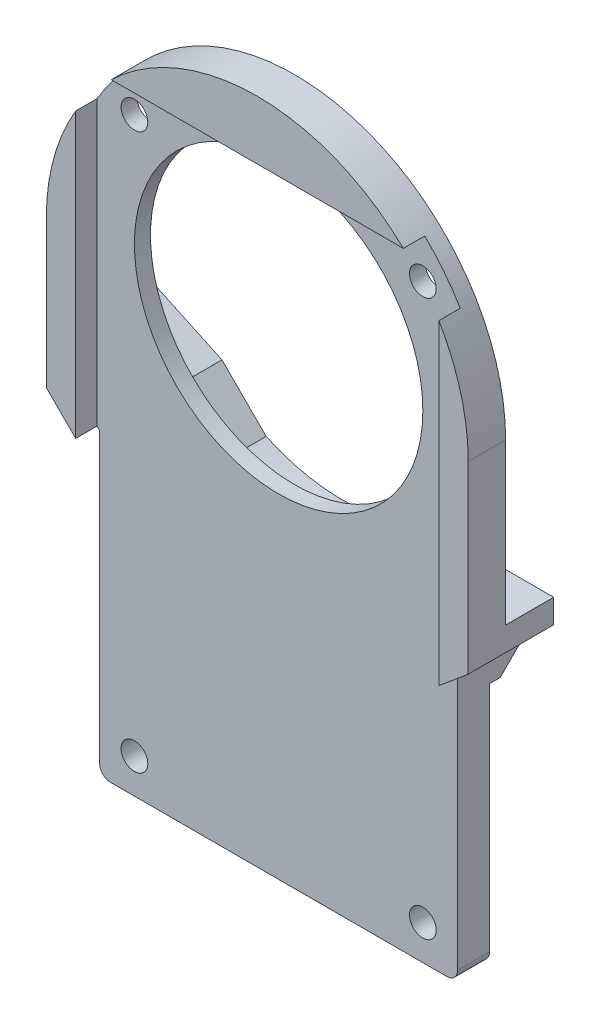
ISO-10303-21;
HEADER;
FILE_DESCRIPTION(('STEP AP214'),'2;1');
FILE_NAME('part.step','',(''),(''),'','','');
FILE_SCHEMA(('AUTOMOTIVE_DESIGN { 1 0 10303 214 1 1 1 1 }'));
ENDSEC;
DATA;
#1=APPLICATION_CONTEXT('core data for automotive mechanical design processes');
#2=APPLICATION_PROTOCOL_DEFINITION('international standard','automotive_design',2000,#1);
#3=PRODUCT_CONTEXT('',#1,'mechanical');
#4=PRODUCT('Part','Part','',(#3));
#5=PRODUCT_RELATED_PRODUCT_CATEGORY('part','',(#4));
#6=PRODUCT_DEFINITION_FORMATION('','',#4);
#7=PRODUCT_DEFINITION_CONTEXT('part definition',#1,'design');
#8=PRODUCT_DEFINITION('design','',#6,#7);
#9=PRODUCT_DEFINITION_SHAPE('','',#8);
#10=(LENGTH_UNIT() NAMED_UNIT(*) SI_UNIT(.MILLI.,.METRE.));
#11=(NAMED_UNIT(*) PLANE_ANGLE_UNIT() SI_UNIT($,.RADIAN.));
#12=(NAMED_UNIT(*) SI_UNIT($,.STERADIAN.) SOLID_ANGLE_UNIT());
#13=UNCERTAINTY_MEASURE_WITH_UNIT(LENGTH_MEASURE(1.E-05),#10,'distance_accuracy_value','');
#14=(GEOMETRIC_REPRESENTATION_CONTEXT(3) GLOBAL_UNCERTAINTY_ASSIGNED_CONTEXT((#13)) GLOBAL_UNIT_ASSIGNED_CONTEXT((#10,
#11,#12)) REPRESENTATION_CONTEXT('',''));
#15=CARTESIAN_POINT('',(0.,0.,0.));
#16=DIRECTION('',(0.,0.,1.));
#17=DIRECTION('',(1.,0.,0.));
#18=AXIS2_PLACEMENT_3D('',#15,#16,#17);
#19=CARTESIAN_POINT('',(0.,0.,0.));
#20=DIRECTION('',(0.,0.,1.));
#21=DIRECTION('',(1.,0.,0.));
#22=AXIS2_PLACEMENT_3D('',#19,#20,#21);
#23=PLANE('',#22);
#24=CARTESIAN_POINT('',(-13.5,-41.5,0.));
#25=DIRECTION('',(0.,0.,-1.));
#26=DIRECTION('',(-1.,0.,0.));
#27=AXIS2_PLACEMENT_3D('',#24,#25,#26);
#28=CIRCLE('',#27,2.75);
#29=CARTESIAN_POINT('',(-16.25,-41.5,0.));
#30=VERTEX_POINT('',#29);
#31=EDGE_CURVE('E354',#30,#30,#28,.T.);
#32=ORIENTED_EDGE('',*,*,#31,.F.);
#33=EDGE_LOOP('',(#32));
#34=FACE_BOUND('',#33,.T.);
#35=CARTESIAN_POINT('',(13.5,-41.5,0.));
#36=DIRECTION('',(0.,0.,-1.));
#37=DIRECTION('',(-1.,0.,0.));
#38=AXIS2_PLACEMENT_3D('',#35,#36,#37);
#39=CIRCLE('',#38,2.75);
#40=CARTESIAN_POINT('',(10.75,-41.5,0.));
#41=VERTEX_POINT('',#40);
#42=EDGE_CURVE('E351',#41,#41,#39,.T.);
#43=ORIENTED_EDGE('',*,*,#42,.F.);
#44=EDGE_LOOP('',(#43));
#45=FACE_BOUND('',#44,.T.);
#46=DIRECTION('',(1.,0.,0.));
#47=VECTOR('',#46,1.);
#48=CARTESIAN_POINT('',(-16.7500000000001,-44.75,0.));
#49=LINE('',#48,#47);
#50=CARTESIAN_POINT('',(-15.7500000000001,-44.75,0.));
#51=VERTEX_POINT('',#50);
#52=CARTESIAN_POINT('',(15.7500000000001,-44.75,0.));
#53=VERTEX_POINT('',#52);
#54=EDGE_CURVE('E377',#51,#53,#49,.T.);
#55=ORIENTED_EDGE('',*,*,#54,.F.);
#56=CARTESIAN_POINT('',(-15.7500000000001,-43.75,0.));
#57=DIRECTION('',(0.,0.,1.));
#58=DIRECTION('',(1.,0.,0.));
#59=AXIS2_PLACEMENT_3D('',#56,#57,#58);
#60=CIRCLE('',#59,1.);
#61=CARTESIAN_POINT('',(-16.7500000000001,-43.75,0.));
#62=VERTEX_POINT('',#61);
#63=EDGE_CURVE('E441',#51,#62,#60,.F.);
#64=ORIENTED_EDGE('',*,*,#63,.T.);
#65=DIRECTION('',(0.,-1.,0.));
#66=VECTOR('',#65,1.);
#67=CARTESIAN_POINT('',(-16.7500000000001,-16.75,0.));
#68=LINE('',#67,#66);
#69=CARTESIAN_POINT('',(-16.7500000000001,-19.,0.));
#70=VERTEX_POINT('',#69);
#71=EDGE_CURVE('E375',#70,#62,#68,.T.);
#72=ORIENTED_EDGE('',*,*,#71,.F.);
#73=DIRECTION('',(-0.707106781186548,0.707106781186548,0.));
#74=VECTOR('',#73,1.);
#75=CARTESIAN_POINT('',(-16.7500000000001,-19.,0.));
#76=LINE('',#75,#74);
#77=CARTESIAN_POINT('',(-13.7500000000001,-22.,0.));
#78=VERTEX_POINT('',#77);
#79=EDGE_CURVE('E266',#78,#70,#76,.T.);
#80=ORIENTED_EDGE('',*,*,#79,.F.);
#81=DIRECTION('',(-1.,0.,0.));
#82=VECTOR('',#81,1.);
#83=CARTESIAN_POINT('',(16.7500000000001,-22.,0.));
#84=LINE('',#83,#82);
#85=CARTESIAN_POINT('',(16.75,-22.,0.));
#86=VERTEX_POINT('',#85);
#87=EDGE_CURVE('E283',#86,#78,#84,.T.);
#88=ORIENTED_EDGE('',*,*,#87,.F.);
#89=DIRECTION('',(0.,1.,0.));
#90=VECTOR('',#89,1.);
#91=CARTESIAN_POINT('',(16.75,-19.75,0.));
#92=LINE('',#91,#90);
#93=CARTESIAN_POINT('',(16.7500000000001,-43.75,0.));
#94=VERTEX_POINT('',#93);
#95=EDGE_CURVE('E362',#94,#86,#92,.T.);
#96=ORIENTED_EDGE('',*,*,#95,.F.);
#97=CARTESIAN_POINT('',(15.7500000000001,-43.75,0.));
#98=DIRECTION('',(0.,0.,1.));
#99=DIRECTION('',(1.,0.,0.));
#100=AXIS2_PLACEMENT_3D('',#97,#98,#99);
#101=CIRCLE('',#100,1.);
#102=EDGE_CURVE('E439',#94,#53,#101,.F.);
#103=ORIENTED_EDGE('',*,*,#102,.T.);
#104=EDGE_LOOP('',(#55,#64,#72,#80,#88,#96,#103));
#105=FACE_BOUND('',#104,.T.);
#106=ADVANCED_FACE('F43',(#34,#45,#105),#23,.F.);
#107=CARTESIAN_POINT('',(-13.5,-41.5,5.));
#108=DIRECTION('',(0.,0.,-1.));
#109=DIRECTION('',(-1.,0.,0.));
#110=AXIS2_PLACEMENT_3D('',#107,#108,#109);
#111=CYLINDRICAL_SURFACE('',#110,1.25000000000001);
#112=CARTESIAN_POINT('',(-13.5,-41.5,1.));
#113=DIRECTION('',(0.,0.,-1.));
#114=DIRECTION('',(-1.,0.,0.));
#115=AXIS2_PLACEMENT_3D('',#112,#113,#114);
#116=CIRCLE('',#115,1.25000000000001);
#117=CARTESIAN_POINT('',(-14.75,-41.5,1.));
#118=VERTEX_POINT('',#117);
#119=EDGE_CURVE('E378',#118,#118,#116,.T.);
#120=ORIENTED_EDGE('',*,*,#119,.T.);
#121=EDGE_LOOP('',(#120));
#122=FACE_BOUND('',#121,.T.);
#123=CARTESIAN_POINT('',(-13.5,-41.5,3.));
#124=DIRECTION('',(0.,0.,1.));
#125=DIRECTION('',(1.,0.,0.));
#126=AXIS2_PLACEMENT_3D('',#123,#124,#125);
#127=CIRCLE('',#126,1.25000000000001);
#128=CARTESIAN_POINT('',(-12.25,-41.5,3.));
#129=VERTEX_POINT('',#128);
#130=EDGE_CURVE('E337',#129,#129,#127,.T.);
#131=ORIENTED_EDGE('',*,*,#130,.T.);
#132=EDGE_LOOP('',(#131));
#133=FACE_BOUND('',#132,.T.);
#134=ADVANCED_FACE('F489',(#122,#133),#111,.F.);
#135=CARTESIAN_POINT('',(13.5,-41.5,5.));
#136=DIRECTION('',(0.,0.,-1.));
#137=DIRECTION('',(-1.,0.,0.));
#138=AXIS2_PLACEMENT_3D('',#135,#136,#137);
#139=CYLINDRICAL_SURFACE('',#138,1.25000000000001);
#140=CARTESIAN_POINT('',(13.5,-41.5,1.));
#141=DIRECTION('',(0.,0.,-1.));
#142=DIRECTION('',(-1.,0.,0.));
#143=AXIS2_PLACEMENT_3D('',#140,#141,#142);
#144=CIRCLE('',#143,1.25000000000001);
#145=CARTESIAN_POINT('',(12.25,-41.5,1.));
#146=VERTEX_POINT('',#145);
#147=EDGE_CURVE('E350',#146,#146,#144,.T.);
#148=ORIENTED_EDGE('',*,*,#147,.T.);
#149=EDGE_LOOP('',(#148));
#150=FACE_BOUND('',#149,.T.);
#151=CARTESIAN_POINT('',(13.5,-41.5,3.));
#152=DIRECTION('',(0.,0.,1.));
#153=DIRECTION('',(1.,0.,0.));
#154=AXIS2_PLACEMENT_3D('',#151,#152,#153);
#155=CIRCLE('',#154,1.25000000000001);
#156=CARTESIAN_POINT('',(14.75,-41.5,3.));
#157=VERTEX_POINT('',#156);
#158=EDGE_CURVE('E334',#157,#157,#155,.T.);
#159=ORIENTED_EDGE('',*,*,#158,.T.);
#160=EDGE_LOOP('',(#159));
#161=FACE_BOUND('',#160,.T.);
#162=ADVANCED_FACE('F495',(#150,#161),#139,.F.);
#163=CARTESIAN_POINT('',(0.,0.,5.));
#164=DIRECTION('',(0.,0.,1.));
#165=DIRECTION('',(1.,0.,0.));
#166=AXIS2_PLACEMENT_3D('',#163,#164,#165);
#167=PLANE('',#166);
#168=DIRECTION('',(0.,1.,0.));
#169=VECTOR('',#168,1.);
#170=CARTESIAN_POINT('',(17.,-44.75,5.));
#171=LINE('',#170,#169);
#172=CARTESIAN_POINT('',(17.,-19.5402250922056,5.));
#173=VERTEX_POINT('',#172);
#174=CARTESIAN_POINT('',(17.,10.0529846314417,5.));
#175=VERTEX_POINT('',#174);
#176=EDGE_CURVE('E300',#173,#175,#171,.T.);
#177=ORIENTED_EDGE('',*,*,#176,.F.);
#178=DIRECTION('',(0.766044443118993,0.642787609686521,0.));
#179=VECTOR('',#178,1.);
#180=CARTESIAN_POINT('',(16.75,-19.75,5.));
#181=LINE('',#180,#179);
#182=CARTESIAN_POINT('',(19.7500000000001,-17.2327011064682,5.));
#183=VERTEX_POINT('',#182);
#184=EDGE_CURVE('E359',#173,#183,#181,.T.);
#185=ORIENTED_EDGE('',*,*,#184,.T.);
#186=DIRECTION('',(0.,1.,0.));
#187=VECTOR('',#186,1.);
#188=CARTESIAN_POINT('',(19.7500000000001,-17.2327011064682,5.));
#189=LINE('',#188,#187);
#190=CARTESIAN_POINT('',(19.7500000000001,0.,5.));
#191=VERTEX_POINT('',#190);
#192=EDGE_CURVE('E361',#183,#191,#189,.T.);
#193=ORIENTED_EDGE('',*,*,#192,.T.);
#194=CARTESIAN_POINT('',(0.,0.,5.));
#195=DIRECTION('',(0.,0.,1.));
#196=DIRECTION('',(1.,0.,0.));
#197=AXIS2_PLACEMENT_3D('',#194,#195,#196);
#198=CIRCLE('',#197,19.7500000000001);
#199=EDGE_CURVE('E365',#191,#175,#198,.T.);
#200=ORIENTED_EDGE('',*,*,#199,.T.);
#201=EDGE_LOOP('',(#177,#185,#193,#200));
#202=FACE_BOUND('',#201,.T.);
#203=ADVANCED_FACE('F607',(#202),#167,.T.);
#204=DIRECTION('',(0.,-1.,0.));
#205=VECTOR('',#204,1.);
#206=CARTESIAN_POINT('',(-17.,-44.75,5.));
#207=LINE('',#206,#205);
#208=CARTESIAN_POINT('',(-17.,10.0529846314417,5.));
#209=VERTEX_POINT('',#208);
#210=CARTESIAN_POINT('',(-17.,-16.5000000000001,5.));
#211=VERTEX_POINT('',#210);
#212=EDGE_CURVE('E305',#209,#211,#207,.T.);
#213=ORIENTED_EDGE('',*,*,#212,.F.);
#214=CARTESIAN_POINT('',(-19.7500000000001,0.,5.));
#215=VERTEX_POINT('',#214);
#216=EDGE_CURVE('E364',#209,#215,#198,.T.);
#217=ORIENTED_EDGE('',*,*,#216,.T.);
#218=DIRECTION('',(0.,-1.,0.));
#219=VECTOR('',#218,1.);
#220=CARTESIAN_POINT('',(-19.7500000000001,-13.75,5.));
#221=LINE('',#220,#219);
#222=CARTESIAN_POINT('',(-19.7500000000001,-13.75,5.));
#223=VERTEX_POINT('',#222);
#224=EDGE_CURVE('E368',#215,#223,#221,.T.);
#225=ORIENTED_EDGE('',*,*,#224,.T.);
#226=DIRECTION('',(0.707106781186547,-0.707106781186547,0.));
#227=VECTOR('',#226,1.);
#228=CARTESIAN_POINT('',(-16.7500000000001,-16.75,5.));
#229=LINE('',#228,#227);
#230=EDGE_CURVE('E371',#223,#211,#229,.T.);
#231=ORIENTED_EDGE('',*,*,#230,.T.);
#232=EDGE_LOOP('',(#213,#217,#225,#231));
#233=FACE_BOUND('',#232,.T.);
#234=ADVANCED_FACE('F532',(#233),#167,.T.);
#235=CARTESIAN_POINT('',(-16.7500000000001,-16.75,5.));
#236=DIRECTION('',(1.,0.,0.));
#237=DIRECTION('',(0.,1.,0.));
#238=AXIS2_PLACEMENT_3D('',#235,#236,#237);
#239=PLANE('',#238);
#240=ORIENTED_EDGE('',*,*,#71,.T.);
#241=DIRECTION('',(0.,0.,-1.));
#242=VECTOR('',#241,1.);
#243=CARTESIAN_POINT('',(-16.7500000000001,-43.75,5.));
#244=LINE('',#243,#242);
#245=CARTESIAN_POINT('',(-16.7500000000001,-43.75,3.));
#246=VERTEX_POINT('',#245);
#247=EDGE_CURVE('E66',#62,#246,#244,.F.);
#248=ORIENTED_EDGE('',*,*,#247,.T.);
#249=DIRECTION('',(0.,-1.,0.));
#250=VECTOR('',#249,1.);
#251=CARTESIAN_POINT('',(-16.7500000000001,-16.75,3.));
#252=LINE('',#251,#250);
#253=CARTESIAN_POINT('',(-16.7500000000001,-16.75,3.));
#254=VERTEX_POINT('',#253);
#255=EDGE_CURVE('E325',#254,#246,#252,.T.);
#256=ORIENTED_EDGE('',*,*,#255,.F.);
#257=DIRECTION('',(0.,0.,-1.));
#258=VECTOR('',#257,1.);
#259=CARTESIAN_POINT('',(-16.7500000000001,-16.75,5.));
#260=LINE('',#259,#258);
#261=CARTESIAN_POINT('',(-16.7500000000001,-16.75,-2.59099025766972));
#262=VERTEX_POINT('',#261);
#263=EDGE_CURVE('E374',#254,#262,#260,.T.);
#264=ORIENTED_EDGE('',*,*,#263,.T.);
#265=DIRECTION('',(0.,-0.816496580927726,0.577350269189627));
#266=VECTOR('',#265,1.);
#267=CARTESIAN_POINT('',(-16.7500000000001,-16.3643819168359,-2.86366341922323));
#268=LINE('',#267,#266);
#269=CARTESIAN_POINT('',(-16.7500000000001,-19.,-0.999999999999984));
#270=VERTEX_POINT('',#269);
#271=EDGE_CURVE('E424',#262,#270,#268,.T.);
#272=ORIENTED_EDGE('',*,*,#271,.T.);
#273=DIRECTION('',(0.,0.,1.));
#274=VECTOR('',#273,1.);
#275=CARTESIAN_POINT('',(-16.7500000000001,-19.,-3.));
#276=LINE('',#275,#274);
#277=EDGE_CURVE('E282',#270,#70,#276,.T.);
#278=ORIENTED_EDGE('',*,*,#277,.T.);
#279=EDGE_LOOP('',(#240,#248,#256,#264,#272,#278));
#280=FACE_BOUND('',#279,.T.);
#281=ADVANCED_FACE('F457',(#280),#239,.F.);
#282=CARTESIAN_POINT('',(-16.7500000000001,-44.75,5.));
#283=DIRECTION('',(0.,1.,0.));
#284=DIRECTION('',(-1.,0.,0.));
#285=AXIS2_PLACEMENT_3D('',#282,#283,#284);
#286=PLANE('',#285);
#287=DIRECTION('',(1.,0.,0.));
#288=VECTOR('',#287,1.);
#289=CARTESIAN_POINT('',(17.,-44.75,3.));
#290=LINE('',#289,#288);
#291=CARTESIAN_POINT('',(-15.7500000000001,-44.75,3.));
#292=VERTEX_POINT('',#291);
#293=CARTESIAN_POINT('',(15.7500000000001,-44.75,3.));
#294=VERTEX_POINT('',#293);
#295=EDGE_CURVE('E310',#292,#294,#290,.T.);
#296=ORIENTED_EDGE('',*,*,#295,.F.);
#297=DIRECTION('',(0.,0.,-1.));
#298=VECTOR('',#297,1.);
#299=CARTESIAN_POINT('',(-15.7500000000001,-44.75,5.));
#300=LINE('',#299,#298);
#301=EDGE_CURVE('E436',#292,#51,#300,.T.);
#302=ORIENTED_EDGE('',*,*,#301,.T.);
#303=ORIENTED_EDGE('',*,*,#54,.T.);
#304=DIRECTION('',(0.,0.,-1.));
#305=VECTOR('',#304,1.);
#306=CARTESIAN_POINT('',(15.7500000000001,-44.75,5.));
#307=LINE('',#306,#305);
#308=EDGE_CURVE('E432',#53,#294,#307,.F.);
#309=ORIENTED_EDGE('',*,*,#308,.T.);
#310=EDGE_LOOP('',(#296,#302,#303,#309));
#311=FACE_BOUND('',#310,.T.);
#312=ADVANCED_FACE('F450',(#311),#286,.F.);
#313=CARTESIAN_POINT('',(16.75,-19.75,5.));
#314=DIRECTION('',(-1.,0.,0.));
#315=DIRECTION('',(0.,-1.,0.));
#316=AXIS2_PLACEMENT_3D('',#313,#314,#315);
#317=PLANE('',#316);
#318=DIRECTION('',(0.,1.,0.));
#319=VECTOR('',#318,1.);
#320=CARTESIAN_POINT('',(16.75,-19.75,3.));
#321=LINE('',#320,#319);
#322=CARTESIAN_POINT('',(16.7500000000001,-43.75,3.));
#323=VERTEX_POINT('',#322);
#324=CARTESIAN_POINT('',(16.75,-19.75,3.));
#325=VERTEX_POINT('',#324);
#326=EDGE_CURVE('E332',#323,#325,#321,.T.);
#327=ORIENTED_EDGE('',*,*,#326,.F.);
#328=DIRECTION('',(0.,0.,-1.));
#329=VECTOR('',#328,1.);
#330=CARTESIAN_POINT('',(16.7500000000001,-43.75,5.));
#331=LINE('',#330,#329);
#332=EDGE_CURVE('E12',#323,#94,#331,.T.);
#333=ORIENTED_EDGE('',*,*,#332,.T.);
#334=ORIENTED_EDGE('',*,*,#95,.T.);
#335=DIRECTION('',(0.,0.,1.));
#336=VECTOR('',#335,1.);
#337=CARTESIAN_POINT('',(16.7500000000001,-22.,-3.));
#338=LINE('',#337,#336);
#339=CARTESIAN_POINT('',(16.7500000000001,-22.,-0.999999999999984));
#340=VERTEX_POINT('',#339);
#341=EDGE_CURVE('E291',#340,#86,#338,.T.);
#342=ORIENTED_EDGE('',*,*,#341,.F.);
#343=DIRECTION('',(0.,0.707106781186548,-0.707106781186548));
#344=VECTOR('',#343,1.);
#345=CARTESIAN_POINT('',(16.75,-19.9999999999999,-3.00000000000004));
#346=LINE('',#345,#344);
#347=CARTESIAN_POINT('',(16.7500000000001,-20.,-3.));
#348=VERTEX_POINT('',#347);
#349=EDGE_CURVE('E430',#340,#348,#346,.T.);
#350=ORIENTED_EDGE('',*,*,#349,.T.);
#351=DIRECTION('',(0.,-1.,0.));
#352=VECTOR('',#351,1.);
#353=CARTESIAN_POINT('',(16.7500000000001,-22.,-3.));
#354=LINE('',#353,#352);
#355=CARTESIAN_POINT('',(16.7500000000001,-19.7499999999999,-3.));
#356=VERTEX_POINT('',#355);
#357=EDGE_CURVE('E279',#356,#348,#354,.T.);
#358=ORIENTED_EDGE('',*,*,#357,.F.);
#359=DIRECTION('',(0.,0.,-1.));
#360=VECTOR('',#359,1.);
#361=CARTESIAN_POINT('',(16.75,-19.75,5.));
#362=LINE('',#361,#360);
#363=EDGE_CURVE('E395',#325,#356,#362,.T.);
#364=ORIENTED_EDGE('',*,*,#363,.F.);
#365=EDGE_LOOP('',(#327,#333,#334,#342,#350,#358,#364));
#366=FACE_BOUND('',#365,.T.);
#367=ADVANCED_FACE('F479',(#366),#317,.F.);
#368=CARTESIAN_POINT('',(0.,0.,5.));
#369=DIRECTION('',(0.,0.,-1.));
#370=DIRECTION('',(-1.,0.,0.));
#371=AXIS2_PLACEMENT_3D('',#368,#369,#370);
#372=CYLINDRICAL_SURFACE('',#371,13.5);
#373=CARTESIAN_POINT('',(0.,0.,1.5));
#374=DIRECTION('',(0.,0.,1.));
#375=DIRECTION('',(1.,0.,0.));
#376=AXIS2_PLACEMENT_3D('',#373,#374,#375);
#377=CIRCLE('',#376,13.5);
#378=CARTESIAN_POINT('',(13.5,0.,1.5));
#379=VERTEX_POINT('',#378);
#380=EDGE_CURVE('E259',#379,#379,#377,.T.);
#381=ORIENTED_EDGE('',*,*,#380,.F.);
#382=EDGE_LOOP('',(#381));
#383=FACE_BOUND('',#382,.T.);
#384=CARTESIAN_POINT('',(0.,0.,3.));
#385=DIRECTION('',(0.,0.,1.));
#386=DIRECTION('',(1.,0.,0.));
#387=AXIS2_PLACEMENT_3D('',#384,#385,#386);
#388=CIRCLE('',#387,13.5);
#389=CARTESIAN_POINT('',(13.5,0.,3.));
#390=VERTEX_POINT('',#389);
#391=EDGE_CURVE('E320',#390,#390,#388,.T.);
#392=ORIENTED_EDGE('',*,*,#391,.T.);
#393=EDGE_LOOP('',(#392));
#394=FACE_BOUND('',#393,.T.);
#395=ADVANCED_FACE('F527',(#383,#394),#372,.F.);
#396=CARTESIAN_POINT('',(-13.5,10.5,5.));
#397=DIRECTION('',(0.,0.,-1.));
#398=DIRECTION('',(-1.,0.,0.));
#399=AXIS2_PLACEMENT_3D('',#396,#397,#398);
#400=CYLINDRICAL_SURFACE('',#399,1.25);
#401=CARTESIAN_POINT('',(-13.5,10.5,1.5));
#402=DIRECTION('',(0.,0.,1.));
#403=DIRECTION('',(1.,0.,0.));
#404=AXIS2_PLACEMENT_3D('',#401,#402,#403);
#405=CIRCLE('',#404,1.25);
#406=CARTESIAN_POINT('',(-12.25,10.5,1.5));
#407=VERTEX_POINT('',#406);
#408=EDGE_CURVE('E256',#407,#407,#405,.T.);
#409=ORIENTED_EDGE('',*,*,#408,.F.);
#410=EDGE_LOOP('',(#409));
#411=FACE_BOUND('',#410,.T.);
#412=CARTESIAN_POINT('',(-13.5,10.5,3.));
#413=DIRECTION('',(0.,0.,1.));
#414=DIRECTION('',(1.,0.,0.));
#415=AXIS2_PLACEMENT_3D('',#412,#413,#414);
#416=CIRCLE('',#415,1.25);
#417=CARTESIAN_POINT('',(-12.25,10.5,3.));
#418=VERTEX_POINT('',#417);
#419=EDGE_CURVE('E317',#418,#418,#416,.T.);
#420=ORIENTED_EDGE('',*,*,#419,.T.);
#421=EDGE_LOOP('',(#420));
#422=FACE_BOUND('',#421,.T.);
#423=ADVANCED_FACE('F601',(#411,#422),#400,.F.);
#424=CARTESIAN_POINT('',(13.5,10.5,5.));
#425=DIRECTION('',(0.,0.,-1.));
#426=DIRECTION('',(-1.,0.,0.));
#427=AXIS2_PLACEMENT_3D('',#424,#425,#426);
#428=CYLINDRICAL_SURFACE('',#427,1.25);
#429=CARTESIAN_POINT('',(13.5,10.5,1.5));
#430=DIRECTION('',(0.,0.,1.));
#431=DIRECTION('',(1.,0.,0.));
#432=AXIS2_PLACEMENT_3D('',#429,#430,#431);
#433=CIRCLE('',#432,1.25);
#434=CARTESIAN_POINT('',(14.75,10.5,1.5));
#435=VERTEX_POINT('',#434);
#436=EDGE_CURVE('E245',#435,#435,#433,.T.);
#437=ORIENTED_EDGE('',*,*,#436,.F.);
#438=EDGE_LOOP('',(#437));
#439=FACE_BOUND('',#438,.T.);
#440=CARTESIAN_POINT('',(13.5,10.5,3.));
#441=DIRECTION('',(0.,0.,1.));
#442=DIRECTION('',(1.,0.,0.));
#443=AXIS2_PLACEMENT_3D('',#440,#441,#442);
#444=CIRCLE('',#443,1.25);
#445=CARTESIAN_POINT('',(14.75,10.5,3.));
#446=VERTEX_POINT('',#445);
#447=EDGE_CURVE('E312',#446,#446,#444,.T.);
#448=ORIENTED_EDGE('',*,*,#447,.T.);
#449=EDGE_LOOP('',(#448));
#450=FACE_BOUND('',#449,.T.);
#451=ADVANCED_FACE('F598',(#439,#450),#428,.F.);
#452=DIRECTION('',(-1.,0.,0.));
#453=VECTOR('',#452,1.);
#454=CARTESIAN_POINT('',(17.,14.25,5.));
#455=LINE('',#454,#453);
#456=CARTESIAN_POINT('',(13.6747943311775,14.25,5.));
#457=VERTEX_POINT('',#456);
#458=CARTESIAN_POINT('',(-13.6747943311775,14.25,5.));
#459=VERTEX_POINT('',#458);
#460=EDGE_CURVE('E314',#457,#459,#455,.T.);
#461=ORIENTED_EDGE('',*,*,#460,.F.);
#462=EDGE_CURVE('E369',#457,#459,#198,.T.);
#463=ORIENTED_EDGE('',*,*,#462,.T.);
#464=EDGE_LOOP('',(#461,#463));
#465=FACE_BOUND('',#464,.T.);
#466=ADVANCED_FACE('F502',(#465),#167,.T.);
#467=CARTESIAN_POINT('',(16.75,-19.75,5.));
#468=DIRECTION('',(-0.642787609686521,0.766044443118993,0.));
#469=DIRECTION('',(-0.766044443118993,-0.642787609686521,0.));
#470=AXIS2_PLACEMENT_3D('',#467,#468,#469);
#471=PLANE('',#470);
#472=ORIENTED_EDGE('',*,*,#184,.F.);
#473=DIRECTION('',(0.,0.,-1.));
#474=VECTOR('',#473,1.);
#475=CARTESIAN_POINT('',(17.,-19.5402250922056,5.));
#476=LINE('',#475,#474);
#477=CARTESIAN_POINT('',(17.,-19.5402250922056,3.));
#478=VERTEX_POINT('',#477);
#479=EDGE_CURVE('E343',#173,#478,#476,.T.);
#480=ORIENTED_EDGE('',*,*,#479,.T.);
#481=DIRECTION('',(0.766044443118993,0.642787609686521,0.));
#482=VECTOR('',#481,1.);
#483=CARTESIAN_POINT('',(16.75,-19.75,3.));
#484=LINE('',#483,#482);
#485=EDGE_CURVE('E330',#325,#478,#484,.T.);
#486=ORIENTED_EDGE('',*,*,#485,.F.);
#487=ORIENTED_EDGE('',*,*,#363,.T.);
#488=DIRECTION('',(-0.766044443118993,-0.642787609686521,0.));
#489=VECTOR('',#488,1.);
#490=CARTESIAN_POINT('',(16.7500000000001,-19.7499999999999,-3.));
#491=LINE('',#490,#489);
#492=CARTESIAN_POINT('',(19.7500000000001,-17.2327011064682,-3.));
#493=VERTEX_POINT('',#492);
#494=EDGE_CURVE('E276',#493,#356,#491,.T.);
#495=ORIENTED_EDGE('',*,*,#494,.F.);
#496=DIRECTION('',(0.,0.,-1.));
#497=VECTOR('',#496,1.);
#498=CARTESIAN_POINT('',(19.7500000000001,-17.2327011064682,5.));
#499=LINE('',#498,#497);
#500=EDGE_CURVE('E393',#183,#493,#499,.T.);
#501=ORIENTED_EDGE('',*,*,#500,.F.);
#502=EDGE_LOOP('',(#472,#480,#486,#487,#495,#501));
#503=FACE_BOUND('',#502,.T.);
#504=ADVANCED_FACE('F520',(#503),#471,.F.);
#505=CARTESIAN_POINT('',(19.7500000000001,-17.2327011064682,5.));
#506=DIRECTION('',(-1.,0.,0.));
#507=DIRECTION('',(0.,0.,1.));
#508=AXIS2_PLACEMENT_3D('',#505,#506,#507);
#509=PLANE('',#508);
#510=DIRECTION('',(0.,0.,1.));
#511=VECTOR('',#510,1.);
#512=CARTESIAN_POINT('',(19.7500000000001,-15.,-3.));
#513=LINE('',#512,#511);
#514=CARTESIAN_POINT('',(19.7500000000001,-15.,-3.));
#515=VERTEX_POINT('',#514);
#516=CARTESIAN_POINT('',(19.7500000000001,-15.,1.5));
#517=VERTEX_POINT('',#516);
#518=EDGE_CURVE('E228',#515,#517,#513,.T.);
#519=ORIENTED_EDGE('',*,*,#518,.T.);
#520=DIRECTION('',(0.,-1.,0.));
#521=VECTOR('',#520,1.);
#522=CARTESIAN_POINT('',(19.7500000000001,0.,1.5));
#523=LINE('',#522,#521);
#524=CARTESIAN_POINT('',(19.7500000000001,0.,1.5));
#525=VERTEX_POINT('',#524);
#526=EDGE_CURVE('E241',#525,#517,#523,.T.);
#527=ORIENTED_EDGE('',*,*,#526,.F.);
#528=DIRECTION('',(0.,0.,-1.));
#529=VECTOR('',#528,1.);
#530=CARTESIAN_POINT('',(19.7500000000001,0.,5.));
#531=LINE('',#530,#529);
#532=EDGE_CURVE('E390',#191,#525,#531,.T.);
#533=ORIENTED_EDGE('',*,*,#532,.F.);
#534=ORIENTED_EDGE('',*,*,#192,.F.);
#535=ORIENTED_EDGE('',*,*,#500,.T.);
#536=DIRECTION('',(0.,-1.,0.));
#537=VECTOR('',#536,1.);
#538=CARTESIAN_POINT('',(19.7500000000001,-17.2327011064682,-3.));
#539=LINE('',#538,#537);
#540=EDGE_CURVE('E273',#515,#493,#539,.T.);
#541=ORIENTED_EDGE('',*,*,#540,.F.);
#542=EDGE_LOOP('',(#519,#527,#533,#534,#535,#541));
#543=FACE_BOUND('',#542,.T.);
#544=ADVANCED_FACE('F516',(#543),#509,.F.);
#545=CARTESIAN_POINT('',(0.,0.,5.));
#546=DIRECTION('',(0.,0.,-1.));
#547=DIRECTION('',(-1.,0.,0.));
#548=AXIS2_PLACEMENT_3D('',#545,#546,#547);
#549=CYLINDRICAL_SURFACE('',#548,19.7500000000001);
#550=ORIENTED_EDGE('',*,*,#532,.T.);
#551=CARTESIAN_POINT('',(0.,0.,1.5));
#552=DIRECTION('',(0.,0.,1.));
#553=DIRECTION('',(1.,0.,0.));
#554=AXIS2_PLACEMENT_3D('',#551,#552,#553);
#555=CIRCLE('',#554,19.7500000000001);
#556=CARTESIAN_POINT('',(-19.7500000000001,0.,1.5));
#557=VERTEX_POINT('',#556);
#558=EDGE_CURVE('E246',#557,#525,#555,.F.);
#559=ORIENTED_EDGE('',*,*,#558,.F.);
#560=DIRECTION('',(0.,0.,-1.));
#561=VECTOR('',#560,1.);
#562=CARTESIAN_POINT('',(-19.7500000000001,0.,5.));
#563=LINE('',#562,#561);
#564=EDGE_CURVE('E387',#215,#557,#563,.T.);
#565=ORIENTED_EDGE('',*,*,#564,.F.);
#566=ORIENTED_EDGE('',*,*,#216,.F.);
#567=DIRECTION('',(0.,0.,-1.));
#568=VECTOR('',#567,1.);
#569=CARTESIAN_POINT('',(-17.,10.0529846314417,5.));
#570=LINE('',#569,#568);
#571=CARTESIAN_POINT('',(-17.,10.0529846314417,3.));
#572=VERTEX_POINT('',#571);
#573=EDGE_CURVE('E340',#209,#572,#570,.T.);
#574=ORIENTED_EDGE('',*,*,#573,.T.);
#575=CARTESIAN_POINT('',(0.,0.,3.));
#576=DIRECTION('',(0.,0.,1.));
#577=DIRECTION('',(1.,0.,0.));
#578=AXIS2_PLACEMENT_3D('',#575,#576,#577);
#579=CIRCLE('',#578,19.7500000000001);
#580=CARTESIAN_POINT('',(-13.6747943311775,14.25,3.));
#581=VERTEX_POINT('',#580);
#582=EDGE_CURVE('E327',#581,#572,#579,.T.);
#583=ORIENTED_EDGE('',*,*,#582,.F.);
#584=DIRECTION('',(0.,0.,-1.));
#585=VECTOR('',#584,1.);
#586=CARTESIAN_POINT('',(-13.6747943311775,14.25,5.));
#587=LINE('',#586,#585);
#588=EDGE_CURVE('E406',#581,#459,#587,.F.);
#589=ORIENTED_EDGE('',*,*,#588,.T.);
#590=ORIENTED_EDGE('',*,*,#462,.F.);
#591=DIRECTION('',(0.,0.,-1.));
#592=VECTOR('',#591,1.);
#593=CARTESIAN_POINT('',(13.6747943311775,14.25,5.));
#594=LINE('',#593,#592);
#595=CARTESIAN_POINT('',(13.6747943311775,14.25,3.));
#596=VERTEX_POINT('',#595);
#597=EDGE_CURVE('E409',#457,#596,#594,.T.);
#598=ORIENTED_EDGE('',*,*,#597,.T.);
#599=CARTESIAN_POINT('',(17.,10.0529846314417,3.));
#600=VERTEX_POINT('',#599);
#601=EDGE_CURVE('E329',#600,#596,#579,.T.);
#602=ORIENTED_EDGE('',*,*,#601,.F.);
#603=DIRECTION('',(0.,0.,-1.));
#604=VECTOR('',#603,1.);
#605=CARTESIAN_POINT('',(17.,10.0529846314417,5.));
#606=LINE('',#605,#604);
#607=EDGE_CURVE('E412',#600,#175,#606,.F.);
#608=ORIENTED_EDGE('',*,*,#607,.T.);
#609=ORIENTED_EDGE('',*,*,#199,.F.);
#610=EDGE_LOOP('',(#550,#559,#565,#566,#574,#583,#589,#590,#598,#602,#608,#609));
#611=FACE_BOUND('',#610,.T.);
#612=ADVANCED_FACE('F512',(#611),#549,.T.);
#613=CARTESIAN_POINT('',(-19.7500000000001,-13.75,5.));
#614=DIRECTION('',(1.,0.,0.));
#615=DIRECTION('',(0.,1.,0.));
#616=AXIS2_PLACEMENT_3D('',#613,#614,#615);
#617=PLANE('',#616);
#618=ORIENTED_EDGE('',*,*,#564,.T.);
#619=DIRECTION('',(0.,1.,0.));
#620=VECTOR('',#619,1.);
#621=CARTESIAN_POINT('',(-19.7500000000001,-7.3410925358761,1.5));
#622=LINE('',#621,#620);
#623=CARTESIAN_POINT('',(-19.7500000000001,-7.3410925358761,1.5));
#624=VERTEX_POINT('',#623);
#625=EDGE_CURVE('E248',#624,#557,#622,.T.);
#626=ORIENTED_EDGE('',*,*,#625,.F.);
#627=DIRECTION('',(0.,0.,1.));
#628=VECTOR('',#627,1.);
#629=CARTESIAN_POINT('',(-19.7500000000001,-7.3410925358761,-3.));
#630=LINE('',#629,#628);
#631=CARTESIAN_POINT('',(-19.7500000000001,-7.3410925358761,-3.));
#632=VERTEX_POINT('',#631);
#633=EDGE_CURVE('E298',#632,#624,#630,.T.);
#634=ORIENTED_EDGE('',*,*,#633,.F.);
#635=DIRECTION('',(0.,1.,0.));
#636=VECTOR('',#635,1.);
#637=CARTESIAN_POINT('',(-19.7500000000001,-13.75,-3.));
#638=LINE('',#637,#636);
#639=CARTESIAN_POINT('',(-19.7500000000001,-13.1715728752538,-3.));
#640=VERTEX_POINT('',#639);
#641=EDGE_CURVE('E263',#640,#632,#638,.T.);
#642=ORIENTED_EDGE('',*,*,#641,.F.);
#643=DIRECTION('',(0.,-0.816496580927726,0.577350269189626));
#644=VECTOR('',#643,1.);
#645=CARTESIAN_POINT('',(-19.7500000000001,-15.3643819168359,-1.44944985685012));
#646=LINE('',#645,#644);
#647=CARTESIAN_POINT('',(-19.7500000000001,-13.75,-2.59099025766972));
#648=VERTEX_POINT('',#647);
#649=EDGE_CURVE('E420',#640,#648,#646,.T.);
#650=ORIENTED_EDGE('',*,*,#649,.T.);
#651=DIRECTION('',(0.,0.,-1.));
#652=VECTOR('',#651,1.);
#653=CARTESIAN_POINT('',(-19.7500000000001,-13.75,5.));
#654=LINE('',#653,#652);
#655=EDGE_CURVE('E384',#223,#648,#654,.T.);
#656=ORIENTED_EDGE('',*,*,#655,.F.);
#657=ORIENTED_EDGE('',*,*,#224,.F.);
#658=EDGE_LOOP('',(#618,#626,#634,#642,#650,#656,#657));
#659=FACE_BOUND('',#658,.T.);
#660=ADVANCED_FACE('F508',(#659),#617,.F.);
#661=CARTESIAN_POINT('',(-16.7500000000001,-16.75,5.));
#662=DIRECTION('',(0.707106781186548,0.707106781186548,0.));
#663=DIRECTION('',(-0.707106781186548,0.707106781186548,0.));
#664=AXIS2_PLACEMENT_3D('',#661,#662,#663);
#665=PLANE('',#664);
#666=ORIENTED_EDGE('',*,*,#655,.T.);
#667=DIRECTION('',(0.707106781186548,-0.707106781186548,0.));
#668=VECTOR('',#667,1.);
#669=CARTESIAN_POINT('',(-16.75,-16.75,-2.59099025766972));
#670=LINE('',#669,#668);
#671=EDGE_CURVE('E422',#648,#262,#670,.T.);
#672=ORIENTED_EDGE('',*,*,#671,.T.);
#673=ORIENTED_EDGE('',*,*,#263,.F.);
#674=DIRECTION('',(0.707106781186548,-0.707106781186548,0.));
#675=VECTOR('',#674,1.);
#676=CARTESIAN_POINT('',(-16.7500000000001,-16.75,3.));
#677=LINE('',#676,#675);
#678=CARTESIAN_POINT('',(-17.,-16.5000000000001,3.));
#679=VERTEX_POINT('',#678);
#680=EDGE_CURVE('E323',#679,#254,#677,.T.);
#681=ORIENTED_EDGE('',*,*,#680,.F.);
#682=DIRECTION('',(0.,0.,1.));
#683=VECTOR('',#682,1.);
#684=CARTESIAN_POINT('',(-17.,-16.5000000000001,5.));
#685=LINE('',#684,#683);
#686=EDGE_CURVE('E397',#679,#211,#685,.T.);
#687=ORIENTED_EDGE('',*,*,#686,.T.);
#688=ORIENTED_EDGE('',*,*,#230,.F.);
#689=EDGE_LOOP('',(#666,#672,#673,#681,#687,#688));
#690=FACE_BOUND('',#689,.T.);
#691=ADVANCED_FACE('F504',(#690),#665,.F.);
#692=CARTESIAN_POINT('',(13.5,-41.5,1.));
#693=DIRECTION('',(0.,0.,-1.));
#694=DIRECTION('',(-1.,0.,0.));
#695=AXIS2_PLACEMENT_3D('',#692,#693,#694);
#696=CYLINDRICAL_SURFACE('',#695,2.75);
#697=CARTESIAN_POINT('',(13.5,-41.5,1.));
#698=DIRECTION('',(0.,0.,-1.));
#699=DIRECTION('',(-1.,0.,0.));
#700=AXIS2_PLACEMENT_3D('',#697,#698,#699);
#701=CIRCLE('',#700,2.75);
#702=CARTESIAN_POINT('',(10.75,-41.5,1.));
#703=VERTEX_POINT('',#702);
#704=EDGE_CURVE('E347',#703,#703,#701,.T.);
#705=ORIENTED_EDGE('',*,*,#704,.F.);
#706=EDGE_LOOP('',(#705));
#707=FACE_BOUND('',#706,.T.);
#708=ORIENTED_EDGE('',*,*,#42,.T.);
#709=EDGE_LOOP('',(#708));
#710=FACE_BOUND('',#709,.T.);
#711=ADVANCED_FACE('F507',(#707,#710),#696,.F.);
#712=CARTESIAN_POINT('',(13.5,-41.5,1.));
#713=DIRECTION('',(0.,0.,-1.));
#714=DIRECTION('',(-1.,0.,0.));
#715=AXIS2_PLACEMENT_3D('',#712,#713,#714);
#716=PLANE('',#715);
#717=ORIENTED_EDGE('',*,*,#147,.F.);
#718=EDGE_LOOP('',(#717));
#719=FACE_BOUND('',#718,.T.);
#720=ORIENTED_EDGE('',*,*,#704,.T.);
#721=EDGE_LOOP('',(#720));
#722=FACE_BOUND('',#721,.T.);
#723=ADVANCED_FACE('F584',(#719,#722),#716,.T.);
#724=CARTESIAN_POINT('',(-13.5,-41.5,1.));
#725=DIRECTION('',(0.,0.,-1.));
#726=DIRECTION('',(-1.,0.,0.));
#727=AXIS2_PLACEMENT_3D('',#724,#725,#726);
#728=CYLINDRICAL_SURFACE('',#727,2.75);
#729=CARTESIAN_POINT('',(-13.5,-41.5,1.));
#730=DIRECTION('',(0.,0.,-1.));
#731=DIRECTION('',(-1.,0.,0.));
#732=AXIS2_PLACEMENT_3D('',#729,#730,#731);
#733=CIRCLE('',#732,2.75);
#734=CARTESIAN_POINT('',(-16.25,-41.5,1.));
#735=VERTEX_POINT('',#734);
#736=EDGE_CURVE('E346',#735,#735,#733,.T.);
#737=ORIENTED_EDGE('',*,*,#736,.F.);
#738=EDGE_LOOP('',(#737));
#739=FACE_BOUND('',#738,.T.);
#740=ORIENTED_EDGE('',*,*,#31,.T.);
#741=EDGE_LOOP('',(#740));
#742=FACE_BOUND('',#741,.T.);
#743=ADVANCED_FACE('F587',(#739,#742),#728,.F.);
#744=CARTESIAN_POINT('',(-13.5,-41.5,1.));
#745=DIRECTION('',(0.,0.,-1.));
#746=DIRECTION('',(-1.,0.,0.));
#747=AXIS2_PLACEMENT_3D('',#744,#745,#746);
#748=PLANE('',#747);
#749=ORIENTED_EDGE('',*,*,#119,.F.);
#750=EDGE_LOOP('',(#749));
#751=FACE_BOUND('',#750,.T.);
#752=ORIENTED_EDGE('',*,*,#736,.T.);
#753=EDGE_LOOP('',(#752));
#754=FACE_BOUND('',#753,.T.);
#755=ADVANCED_FACE('F582',(#751,#754),#748,.T.);
#756=CARTESIAN_POINT('',(17.,-44.75,3.));
#757=DIRECTION('',(1.,0.,0.));
#758=DIRECTION('',(0.,0.,-1.));
#759=AXIS2_PLACEMENT_3D('',#756,#757,#758);
#760=PLANE('',#759);
#761=ORIENTED_EDGE('',*,*,#176,.T.);
#762=ORIENTED_EDGE('',*,*,#607,.F.);
#763=DIRECTION('',(0.,1.,0.));
#764=VECTOR('',#763,1.);
#765=CARTESIAN_POINT('',(17.,-44.75,3.));
#766=LINE('',#765,#764);
#767=EDGE_CURVE('E301',#478,#600,#766,.T.);
#768=ORIENTED_EDGE('',*,*,#767,.F.);
#769=ORIENTED_EDGE('',*,*,#479,.F.);
#770=EDGE_LOOP('',(#761,#762,#768,#769));
#771=FACE_BOUND('',#770,.T.);
#772=ADVANCED_FACE('F578',(#771),#760,.F.);
#773=CARTESIAN_POINT('',(17.,14.25,3.));
#774=DIRECTION('',(0.,1.,0.));
#775=DIRECTION('',(-1.,0.,0.));
#776=AXIS2_PLACEMENT_3D('',#773,#774,#775);
#777=PLANE('',#776);
#778=ORIENTED_EDGE('',*,*,#460,.T.);
#779=ORIENTED_EDGE('',*,*,#588,.F.);
#780=DIRECTION('',(-1.,0.,0.));
#781=VECTOR('',#780,1.);
#782=CARTESIAN_POINT('',(17.,14.25,3.));
#783=LINE('',#782,#781);
#784=EDGE_CURVE('E304',#596,#581,#783,.T.);
#785=ORIENTED_EDGE('',*,*,#784,.F.);
#786=ORIENTED_EDGE('',*,*,#597,.F.);
#787=EDGE_LOOP('',(#778,#779,#785,#786));
#788=FACE_BOUND('',#787,.T.);
#789=ADVANCED_FACE('F574',(#788),#777,.F.);
#790=CARTESIAN_POINT('',(-17.,-44.75,3.));
#791=DIRECTION('',(-1.,0.,0.));
#792=DIRECTION('',(0.,0.,1.));
#793=AXIS2_PLACEMENT_3D('',#790,#791,#792);
#794=PLANE('',#793);
#795=ORIENTED_EDGE('',*,*,#212,.T.);
#796=ORIENTED_EDGE('',*,*,#686,.F.);
#797=DIRECTION('',(0.,-1.,0.));
#798=VECTOR('',#797,1.);
#799=CARTESIAN_POINT('',(-17.,-44.75,3.));
#800=LINE('',#799,#798);
#801=EDGE_CURVE('E308',#572,#679,#800,.T.);
#802=ORIENTED_EDGE('',*,*,#801,.F.);
#803=ORIENTED_EDGE('',*,*,#573,.F.);
#804=EDGE_LOOP('',(#795,#796,#802,#803));
#805=FACE_BOUND('',#804,.T.);
#806=ADVANCED_FACE('F570',(#805),#794,.F.);
#807=CARTESIAN_POINT('',(0.,0.,3.));
#808=DIRECTION('',(0.,0.,1.));
#809=DIRECTION('',(1.,0.,0.));
#810=AXIS2_PLACEMENT_3D('',#807,#808,#809);
#811=PLANE('',#810);
#812=ORIENTED_EDGE('',*,*,#130,.F.);
#813=EDGE_LOOP('',(#812));
#814=FACE_BOUND('',#813,.T.);
#815=ORIENTED_EDGE('',*,*,#158,.F.);
#816=EDGE_LOOP('',(#815));
#817=FACE_BOUND('',#816,.T.);
#818=ORIENTED_EDGE('',*,*,#391,.F.);
#819=EDGE_LOOP('',(#818));
#820=FACE_BOUND('',#819,.T.);
#821=ORIENTED_EDGE('',*,*,#419,.F.);
#822=EDGE_LOOP('',(#821));
#823=FACE_BOUND('',#822,.T.);
#824=ORIENTED_EDGE('',*,*,#447,.F.);
#825=EDGE_LOOP('',(#824));
#826=FACE_BOUND('',#825,.T.);
#827=ORIENTED_EDGE('',*,*,#255,.T.);
#828=CARTESIAN_POINT('',(-15.7500000000001,-43.75,3.));
#829=DIRECTION('',(0.,0.,1.));
#830=DIRECTION('',(1.,0.,0.));
#831=AXIS2_PLACEMENT_3D('',#828,#829,#830);
#832=CIRCLE('',#831,1.);
#833=EDGE_CURVE('E51',#246,#292,#832,.T.);
#834=ORIENTED_EDGE('',*,*,#833,.T.);
#835=ORIENTED_EDGE('',*,*,#295,.T.);
#836=CARTESIAN_POINT('',(15.7500000000001,-43.75,3.));
#837=DIRECTION('',(0.,0.,1.));
#838=DIRECTION('',(1.,0.,0.));
#839=AXIS2_PLACEMENT_3D('',#836,#837,#838);
#840=CIRCLE('',#839,1.);
#841=EDGE_CURVE('E58',#294,#323,#840,.T.);
#842=ORIENTED_EDGE('',*,*,#841,.T.);
#843=ORIENTED_EDGE('',*,*,#326,.T.);
#844=ORIENTED_EDGE('',*,*,#485,.T.);
#845=ORIENTED_EDGE('',*,*,#767,.T.);
#846=ORIENTED_EDGE('',*,*,#601,.T.);
#847=ORIENTED_EDGE('',*,*,#784,.T.);
#848=ORIENTED_EDGE('',*,*,#582,.T.);
#849=ORIENTED_EDGE('',*,*,#801,.T.);
#850=ORIENTED_EDGE('',*,*,#680,.T.);
#851=EDGE_LOOP('',(#827,#834,#835,#842,#843,#844,#845,#846,#847,#848,#849,#850));
#852=FACE_BOUND('',#851,.T.);
#853=ADVANCED_FACE('F446',(#814,#817,#820,#823,#826,#852),#811,.T.);
#854=CARTESIAN_POINT('',(-11.3007560879156,-11.2810396777006,-3.));
#855=DIRECTION('',(-0.422618261740701,-0.906307787036649,0.));
#856=DIRECTION('',(0.906307787036649,-0.422618261740701,0.));
#857=AXIS2_PLACEMENT_3D('',#854,#855,#856);
#858=PLANE('',#857);
#859=ORIENTED_EDGE('',*,*,#633,.T.);
#860=DIRECTION('',(-0.906307787036649,0.422618261740701,0.));
#861=VECTOR('',#860,1.);
#862=CARTESIAN_POINT('',(-11.3007560879156,-11.2810396777006,1.5));
#863=LINE('',#862,#861);
#864=CARTESIAN_POINT('',(-11.3007560879156,-11.2810396777006,1.5));
#865=VERTEX_POINT('',#864);
#866=EDGE_CURVE('E250',#865,#624,#863,.T.);
#867=ORIENTED_EDGE('',*,*,#866,.F.);
#868=DIRECTION('',(0.,0.,1.));
#869=VECTOR('',#868,1.);
#870=CARTESIAN_POINT('',(-11.3007560879156,-11.2810396777006,-3.));
#871=LINE('',#870,#869);
#872=CARTESIAN_POINT('',(-11.3007560879156,-11.2810396777006,-3.));
#873=VERTEX_POINT('',#872);
#874=EDGE_CURVE('E296',#873,#865,#871,.T.);
#875=ORIENTED_EDGE('',*,*,#874,.F.);
#876=DIRECTION('',(0.906307787036649,-0.422618261740701,0.));
#877=VECTOR('',#876,1.);
#878=CARTESIAN_POINT('',(-11.3007560879156,-11.2810396777006,-3.));
#879=LINE('',#878,#877);
#880=EDGE_CURVE('E265',#632,#873,#879,.T.);
#881=ORIENTED_EDGE('',*,*,#880,.F.);
#882=EDGE_LOOP('',(#859,#867,#875,#881));
#883=FACE_BOUND('',#882,.T.);
#884=ADVANCED_FACE('F563',(#883),#858,.F.);
#885=CARTESIAN_POINT('',(-11.3007560879156,-11.2810396777006,-3.));
#886=DIRECTION('',(-0.707106781186544,-0.707106781186551,0.));
#887=DIRECTION('',(0.707106781186551,-0.707106781186544,0.));
#888=AXIS2_PLACEMENT_3D('',#885,#886,#887);
#889=PLANE('',#888);
#890=ORIENTED_EDGE('',*,*,#874,.T.);
#891=DIRECTION('',(-0.707106781186551,0.707106781186544,0.));
#892=VECTOR('',#891,1.);
#893=CARTESIAN_POINT('',(-7.16589788280808,-15.4158978828081,1.5));
#894=LINE('',#893,#892);
#895=CARTESIAN_POINT('',(-7.16589788280808,-15.4158978828081,1.5));
#896=VERTEX_POINT('',#895);
#897=EDGE_CURVE('E237',#896,#865,#894,.T.);
#898=ORIENTED_EDGE('',*,*,#897,.F.);
#899=DIRECTION('',(0.,0.,1.));
#900=VECTOR('',#899,1.);
#901=CARTESIAN_POINT('',(-7.16589788280808,-15.4158978828081,-3.));
#902=LINE('',#901,#900);
#903=CARTESIAN_POINT('',(-7.16589788280808,-15.4158978828081,-3.));
#904=VERTEX_POINT('',#903);
#905=EDGE_CURVE('E227',#904,#896,#902,.T.);
#906=ORIENTED_EDGE('',*,*,#905,.F.);
#907=DIRECTION('',(0.707106781186551,-0.707106781186544,0.));
#908=VECTOR('',#907,1.);
#909=CARTESIAN_POINT('',(-11.3007560879156,-11.2810396777006,-3.));
#910=LINE('',#909,#908);
#911=EDGE_CURVE('E268',#873,#904,#910,.T.);
#912=ORIENTED_EDGE('',*,*,#911,.F.);
#913=EDGE_LOOP('',(#890,#898,#906,#912));
#914=FACE_BOUND('',#913,.T.);
#915=ADVANCED_FACE('F560',(#914),#889,.F.);
#916=CARTESIAN_POINT('',(0.,0.,-3.));
#917=DIRECTION('',(0.,0.,1.));
#918=DIRECTION('',(1.,0.,0.));
#919=AXIS2_PLACEMENT_3D('',#916,#917,#918);
#920=CYLINDRICAL_SURFACE('',#919,17.);
#921=ORIENTED_EDGE('',*,*,#905,.T.);
#922=CARTESIAN_POINT('',(0.,0.,1.5));
#923=DIRECTION('',(0.,0.,1.));
#924=DIRECTION('',(1.,0.,0.));
#925=AXIS2_PLACEMENT_3D('',#922,#923,#924);
#926=CIRCLE('',#925,17.);
#927=CARTESIAN_POINT('',(8.,-15.,1.5));
#928=VERTEX_POINT('',#927);
#929=EDGE_CURVE('E231',#928,#896,#926,.F.);
#930=ORIENTED_EDGE('',*,*,#929,.F.);
#931=DIRECTION('',(0.,0.,1.));
#932=VECTOR('',#931,1.);
#933=CARTESIAN_POINT('',(8.,-15.,-3.));
#934=LINE('',#933,#932);
#935=CARTESIAN_POINT('',(8.,-15.,-3.));
#936=VERTEX_POINT('',#935);
#937=EDGE_CURVE('E217',#936,#928,#934,.T.);
#938=ORIENTED_EDGE('',*,*,#937,.F.);
#939=CARTESIAN_POINT('',(0.,0.,-3.));
#940=DIRECTION('',(0.,0.,1.));
#941=DIRECTION('',(-1.,0.,0.));
#942=AXIS2_PLACEMENT_3D('',#939,#940,#941);
#943=CIRCLE('',#942,17.);
#944=EDGE_CURVE('E270',#904,#936,#943,.T.);
#945=ORIENTED_EDGE('',*,*,#944,.F.);
#946=EDGE_LOOP('',(#921,#930,#938,#945));
#947=FACE_BOUND('',#946,.T.);
#948=ADVANCED_FACE('F232',(#947),#920,.F.);
#949=CARTESIAN_POINT('',(19.7500000000001,-15.,-3.));
#950=DIRECTION('',(0.,-1.,0.));
#951=DIRECTION('',(0.,0.,-1.));
#952=AXIS2_PLACEMENT_3D('',#949,#950,#951);
#953=PLANE('',#952);
#954=ORIENTED_EDGE('',*,*,#937,.T.);
#955=DIRECTION('',(-1.,0.,0.));
#956=VECTOR('',#955,1.);
#957=CARTESIAN_POINT('',(19.7500000000001,-15.,1.5));
#958=LINE('',#957,#956);
#959=EDGE_CURVE('E222',#517,#928,#958,.T.);
#960=ORIENTED_EDGE('',*,*,#959,.F.);
#961=ORIENTED_EDGE('',*,*,#518,.F.);
#962=DIRECTION('',(1.,0.,0.));
#963=VECTOR('',#962,1.);
#964=CARTESIAN_POINT('',(19.7500000000001,-15.,-3.));
#965=LINE('',#964,#963);
#966=EDGE_CURVE('E224',#936,#515,#965,.T.);
#967=ORIENTED_EDGE('',*,*,#966,.F.);
#968=EDGE_LOOP('',(#954,#960,#961,#967));
#969=FACE_BOUND('',#968,.T.);
#970=ADVANCED_FACE('F219',(#969),#953,.F.);
#971=CARTESIAN_POINT('',(16.7500000000001,-22.,-3.));
#972=DIRECTION('',(0.,1.,0.));
#973=DIRECTION('',(0.,0.,1.));
#974=AXIS2_PLACEMENT_3D('',#971,#972,#973);
#975=PLANE('',#974);
#976=DIRECTION('',(0.,0.,1.));
#977=VECTOR('',#976,1.);
#978=CARTESIAN_POINT('',(-13.7500000000001,-22.,-3.));
#979=LINE('',#978,#977);
#980=CARTESIAN_POINT('',(-13.7500000000001,-22.,-0.999999999999984));
#981=VERTEX_POINT('',#980);
#982=EDGE_CURVE('E289',#981,#78,#979,.T.);
#983=ORIENTED_EDGE('',*,*,#982,.F.);
#984=DIRECTION('',(1.,0.,0.));
#985=VECTOR('',#984,1.);
#986=CARTESIAN_POINT('',(16.7500000000001,-22.,-0.999999999999984));
#987=LINE('',#986,#985);
#988=EDGE_CURVE('E428',#981,#340,#987,.T.);
#989=ORIENTED_EDGE('',*,*,#988,.T.);
#990=ORIENTED_EDGE('',*,*,#341,.T.);
#991=ORIENTED_EDGE('',*,*,#87,.T.);
#992=EDGE_LOOP('',(#983,#989,#990,#991));
#993=FACE_BOUND('',#992,.T.);
#994=ADVANCED_FACE('F476',(#993),#975,.F.);
#995=CARTESIAN_POINT('',(-16.7500000000001,-19.,-3.));
#996=DIRECTION('',(0.707106781186547,0.707106781186547,0.));
#997=DIRECTION('',(-0.707106781186548,0.707106781186548,0.));
#998=AXIS2_PLACEMENT_3D('',#995,#996,#997);
#999=PLANE('',#998);
#1000=ORIENTED_EDGE('',*,*,#277,.F.);
#1001=DIRECTION('',(0.707106781186548,-0.707106781186548,0.));
#1002=VECTOR('',#1001,1.);
#1003=CARTESIAN_POINT('',(-13.7500000000001,-22.,-0.999999999999984));
#1004=LINE('',#1003,#1002);
#1005=EDGE_CURVE('E426',#270,#981,#1004,.T.);
#1006=ORIENTED_EDGE('',*,*,#1005,.T.);
#1007=ORIENTED_EDGE('',*,*,#982,.T.);
#1008=ORIENTED_EDGE('',*,*,#79,.T.);
#1009=EDGE_LOOP('',(#1000,#1006,#1007,#1008));
#1010=FACE_BOUND('',#1009,.T.);
#1011=ADVANCED_FACE('F462',(#1010),#999,.F.);
#1012=CARTESIAN_POINT('',(0.,0.,-3.));
#1013=DIRECTION('',(0.,0.,-1.));
#1014=DIRECTION('',(-1.,0.,0.));
#1015=AXIS2_PLACEMENT_3D('',#1012,#1013,#1014);
#1016=PLANE('',#1015);
#1017=DIRECTION('',(-1.,0.,0.));
#1018=VECTOR('',#1017,1.);
#1019=CARTESIAN_POINT('',(-13.7500000000001,-20.,-3.));
#1020=LINE('',#1019,#1018);
#1021=CARTESIAN_POINT('',(-12.9215728752539,-20.,-3.));
#1022=VERTEX_POINT('',#1021);
#1023=EDGE_CURVE('E415',#348,#1022,#1020,.T.);
#1024=ORIENTED_EDGE('',*,*,#1023,.T.);
#1025=DIRECTION('',(-0.707106781186548,0.707106781186548,0.));
#1026=VECTOR('',#1025,1.);
#1027=CARTESIAN_POINT('',(-15.335786437627,-17.5857864376269,-3.));
#1028=LINE('',#1027,#1026);
#1029=EDGE_CURVE('E417',#1022,#640,#1028,.T.);
#1030=ORIENTED_EDGE('',*,*,#1029,.T.);
#1031=ORIENTED_EDGE('',*,*,#641,.T.);
#1032=ORIENTED_EDGE('',*,*,#880,.T.);
#1033=ORIENTED_EDGE('',*,*,#911,.T.);
#1034=ORIENTED_EDGE('',*,*,#944,.T.);
#1035=ORIENTED_EDGE('',*,*,#966,.T.);
#1036=ORIENTED_EDGE('',*,*,#540,.T.);
#1037=ORIENTED_EDGE('',*,*,#494,.T.);
#1038=ORIENTED_EDGE('',*,*,#357,.T.);
#1039=EDGE_LOOP('',(#1024,#1030,#1031,#1032,#1033,#1034,#1035,#1036,#1037,#1038));
#1040=FACE_BOUND('',#1039,.T.);
#1041=ADVANCED_FACE('F542',(#1040),#1016,.T.);
#1042=CARTESIAN_POINT('',(0.,-20.,-3.));
#1043=DIRECTION('',(0.,-0.707106781186547,-0.707106781186547));
#1044=DIRECTION('',(1.,0.,0.));
#1045=AXIS2_PLACEMENT_3D('',#1042,#1043,#1044);
#1046=PLANE('',#1045);
#1047=ORIENTED_EDGE('',*,*,#349,.F.);
#1048=ORIENTED_EDGE('',*,*,#988,.F.);
#1049=DIRECTION('',(0.281084637714819,0.678598344545847,-0.678598344545847));
#1050=VECTOR('',#1049,1.);
#1051=CARTESIAN_POINT('',(-11.9006578342379,-17.5352930619485,-5.46470693805147));
#1052=LINE('',#1051,#1050);
#1053=EDGE_CURVE('E262',#1022,#981,#1052,.F.);
#1054=ORIENTED_EDGE('',*,*,#1053,.F.);
#1055=ORIENTED_EDGE('',*,*,#1023,.F.);
#1056=EDGE_LOOP('',(#1047,#1048,#1054,#1055));
#1057=FACE_BOUND('',#1056,.T.);
#1058=ADVANCED_FACE('F473',(#1057),#1046,.T.);
#1059=CARTESIAN_POINT('',(-16.4607864376269,-16.4607864376269,-3.));
#1060=DIRECTION('',(-0.5,-0.5,-0.707106781186547));
#1061=DIRECTION('',(0.707106781186548,-0.707106781186548,0.));
#1062=AXIS2_PLACEMENT_3D('',#1059,#1060,#1061);
#1063=PLANE('',#1062);
#1064=ORIENTED_EDGE('',*,*,#1053,.T.);
#1065=ORIENTED_EDGE('',*,*,#1005,.F.);
#1066=ORIENTED_EDGE('',*,*,#271,.F.);
#1067=ORIENTED_EDGE('',*,*,#671,.F.);
#1068=ORIENTED_EDGE('',*,*,#649,.F.);
#1069=ORIENTED_EDGE('',*,*,#1029,.F.);
#1070=EDGE_LOOP('',(#1064,#1065,#1066,#1067,#1068,#1069));
#1071=FACE_BOUND('',#1070,.T.);
#1072=ADVANCED_FACE('F465',(#1071),#1063,.T.);
#1073=CARTESIAN_POINT('',(0.,0.,1.5));
#1074=DIRECTION('',(0.,0.,1.));
#1075=DIRECTION('',(1.,0.,0.));
#1076=AXIS2_PLACEMENT_3D('',#1073,#1074,#1075);
#1077=PLANE('',#1076);
#1078=ORIENTED_EDGE('',*,*,#380,.T.);
#1079=EDGE_LOOP('',(#1078));
#1080=FACE_BOUND('',#1079,.T.);
#1081=ORIENTED_EDGE('',*,*,#408,.T.);
#1082=EDGE_LOOP('',(#1081));
#1083=FACE_BOUND('',#1082,.T.);
#1084=ORIENTED_EDGE('',*,*,#436,.T.);
#1085=EDGE_LOOP('',(#1084));
#1086=FACE_BOUND('',#1085,.T.);
#1087=ORIENTED_EDGE('',*,*,#526,.T.);
#1088=ORIENTED_EDGE('',*,*,#959,.T.);
#1089=ORIENTED_EDGE('',*,*,#929,.T.);
#1090=ORIENTED_EDGE('',*,*,#897,.T.);
#1091=ORIENTED_EDGE('',*,*,#866,.T.);
#1092=ORIENTED_EDGE('',*,*,#625,.T.);
#1093=ORIENTED_EDGE('',*,*,#558,.T.);
#1094=EDGE_LOOP('',(#1087,#1088,#1089,#1090,#1091,#1092,#1093));
#1095=FACE_BOUND('',#1094,.T.);
#1096=ADVANCED_FACE('F239',(#1080,#1083,#1086,#1095),#1077,.F.);
#1097=CARTESIAN_POINT('',(-15.7500000000001,-43.75,5.));
#1098=DIRECTION('',(0.,0.,-1.));
#1099=DIRECTION('',(-1.,0.,0.));
#1100=AXIS2_PLACEMENT_3D('',#1097,#1098,#1099);
#1101=CYLINDRICAL_SURFACE('',#1100,1.);
#1102=ORIENTED_EDGE('',*,*,#833,.F.);
#1103=ORIENTED_EDGE('',*,*,#247,.F.);
#1104=ORIENTED_EDGE('',*,*,#63,.F.);
#1105=ORIENTED_EDGE('',*,*,#301,.F.);
#1106=EDGE_LOOP('',(#1102,#1103,#1104,#1105));
#1107=FACE_BOUND('',#1106,.T.);
#1108=ADVANCED_FACE('F453',(#1107),#1101,.T.);
#1109=CARTESIAN_POINT('',(15.7500000000001,-43.75,5.));
#1110=DIRECTION('',(0.,0.,-1.));
#1111=DIRECTION('',(-1.,0.,0.));
#1112=AXIS2_PLACEMENT_3D('',#1109,#1110,#1111);
#1113=CYLINDRICAL_SURFACE('',#1112,1.);
#1114=ORIENTED_EDGE('',*,*,#841,.F.);
#1115=ORIENTED_EDGE('',*,*,#308,.F.);
#1116=ORIENTED_EDGE('',*,*,#102,.F.);
#1117=ORIENTED_EDGE('',*,*,#332,.F.);
#1118=EDGE_LOOP('',(#1114,#1115,#1116,#1117));
#1119=FACE_BOUND('',#1118,.T.);
#1120=ADVANCED_FACE('F45',(#1119),#1113,.T.);
#1121=CLOSED_SHELL('',(#106,#134,#162,#203,#234,#281,#312,#367,#395,#423,#451,#466,#504,#544,
#612,#660,#691,#711,#723,#743,#755,#772,#789,#806,#853,#884,#915,#948,#970,#994,#1011,#1041,
#1058,#1072,#1096,#1108,#1120));
#1122=MANIFOLD_SOLID_BREP('B2',#1121);
#1123=ADVANCED_BREP_SHAPE_REPRESENTATION('',(#18,#1122),#14);
#1124=SHAPE_DEFINITION_REPRESENTATION(#9,#1123);
ENDSEC;
END-ISO-10303-21;
